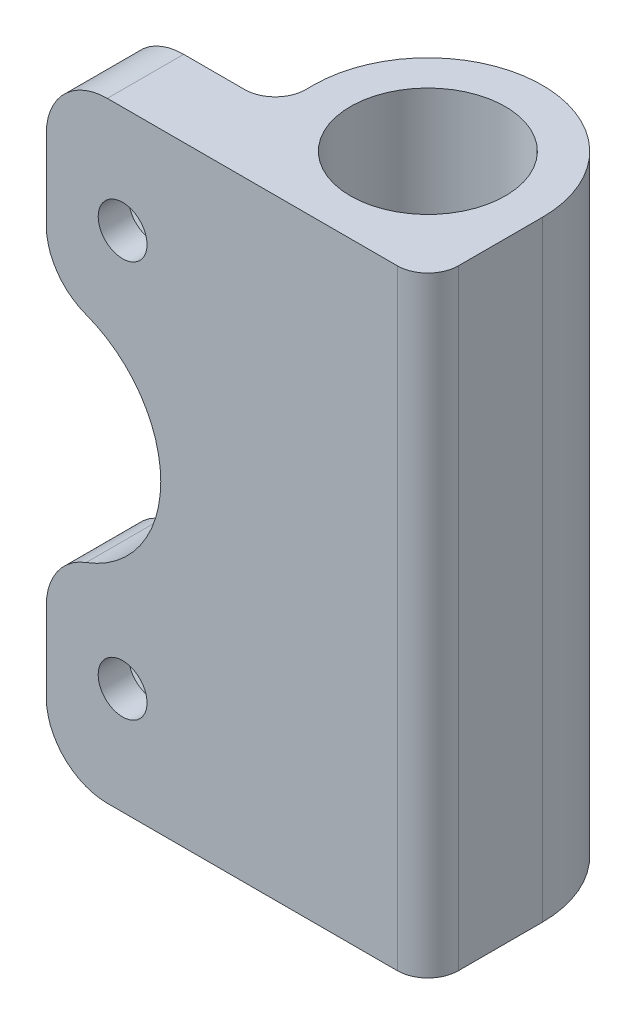
ISO-10303-21;
HEADER;
FILE_DESCRIPTION(('STEP AP214'),'2;1');
FILE_NAME('part.step','',(''),(''),'','','');
FILE_SCHEMA(('AUTOMOTIVE_DESIGN { 1 0 10303 214 1 1 1 1 }'));
ENDSEC;
DATA;
#1=APPLICATION_CONTEXT('core data for automotive mechanical design processes');
#2=APPLICATION_PROTOCOL_DEFINITION('international standard','automotive_design',2000,#1);
#3=PRODUCT_CONTEXT('',#1,'mechanical');
#4=PRODUCT('Part','Part','',(#3));
#5=PRODUCT_RELATED_PRODUCT_CATEGORY('part','',(#4));
#6=PRODUCT_DEFINITION_FORMATION('','',#4);
#7=PRODUCT_DEFINITION_CONTEXT('part definition',#1,'design');
#8=PRODUCT_DEFINITION('design','',#6,#7);
#9=PRODUCT_DEFINITION_SHAPE('','',#8);
#10=(LENGTH_UNIT() NAMED_UNIT(*) SI_UNIT(.MILLI.,.METRE.));
#11=(NAMED_UNIT(*) PLANE_ANGLE_UNIT() SI_UNIT($,.RADIAN.));
#12=(NAMED_UNIT(*) SI_UNIT($,.STERADIAN.) SOLID_ANGLE_UNIT());
#13=UNCERTAINTY_MEASURE_WITH_UNIT(LENGTH_MEASURE(1.E-05),#10,'distance_accuracy_value','');
#14=(GEOMETRIC_REPRESENTATION_CONTEXT(3) GLOBAL_UNCERTAINTY_ASSIGNED_CONTEXT((#13)) GLOBAL_UNIT_ASSIGNED_CONTEXT((#10,
#11,#12)) REPRESENTATION_CONTEXT('',''));
#15=CARTESIAN_POINT('',(0.,0.,0.));
#16=DIRECTION('',(0.,0.,1.));
#17=DIRECTION('',(1.,0.,0.));
#18=AXIS2_PLACEMENT_3D('',#15,#16,#17);
#19=CARTESIAN_POINT('',(-17.5,40.,2.5));
#20=DIRECTION('',(1.,0.,0.));
#21=DIRECTION('',(0.,0.,-1.));
#22=AXIS2_PLACEMENT_3D('',#19,#20,#21);
#23=PLANE('',#22);
#24=DIRECTION('',(0.,-1.,0.));
#25=VECTOR('',#24,1.);
#26=CARTESIAN_POINT('',(-17.5,40.,2.5));
#27=LINE('',#26,#25);
#28=CARTESIAN_POINT('',(-17.5,9.21807067357609,2.5));
#29=VERTEX_POINT('',#28);
#30=CARTESIAN_POINT('',(-17.5,4.,2.5));
#31=VERTEX_POINT('',#30);
#32=EDGE_CURVE('E344',#29,#31,#27,.T.);
#33=ORIENTED_EDGE('',*,*,#32,.T.);
#34=DIRECTION('',(0.,0.,1.));
#35=VECTOR('',#34,1.);
#36=CARTESIAN_POINT('',(-17.5,4.,2.5));
#37=LINE('',#36,#35);
#38=CARTESIAN_POINT('',(-17.5,4.,7.5));
#39=VERTEX_POINT('',#38);
#40=EDGE_CURVE('E374',#31,#39,#37,.T.);
#41=ORIENTED_EDGE('',*,*,#40,.T.);
#42=DIRECTION('',(0.,-1.,0.));
#43=VECTOR('',#42,1.);
#44=CARTESIAN_POINT('',(-17.5,40.,7.5));
#45=LINE('',#44,#43);
#46=CARTESIAN_POINT('',(-17.5,9.21807067357609,7.5));
#47=VERTEX_POINT('',#46);
#48=EDGE_CURVE('E363',#47,#39,#45,.T.);
#49=ORIENTED_EDGE('',*,*,#48,.F.);
#50=DIRECTION('',(0.,0.,-1.));
#51=VECTOR('',#50,1.);
#52=CARTESIAN_POINT('',(-17.5,9.21807067357609,2.5));
#53=LINE('',#52,#51);
#54=EDGE_CURVE('E367',#47,#29,#53,.T.);
#55=ORIENTED_EDGE('',*,*,#54,.T.);
#56=EDGE_LOOP('',(#33,#41,#49,#55));
#57=FACE_BOUND('',#56,.T.);
#58=ADVANCED_FACE('F33',(#57),#23,.F.);
#59=CARTESIAN_POINT('',(-12.5,33.,7.5));
#60=DIRECTION('',(0.,0.,-1.));
#61=DIRECTION('',(-1.,0.,0.));
#62=AXIS2_PLACEMENT_3D('',#59,#60,#61);
#63=CYLINDRICAL_SURFACE('',#62,1.6);
#64=CARTESIAN_POINT('',(-12.5,33.,7.5));
#65=DIRECTION('',(0.,0.,-1.));
#66=DIRECTION('',(-1.,0.,0.));
#67=AXIS2_PLACEMENT_3D('',#64,#65,#66);
#68=CIRCLE('',#67,1.6);
#69=CARTESIAN_POINT('',(-14.1,33.,7.5));
#70=VERTEX_POINT('',#69);
#71=EDGE_CURVE('E322',#70,#70,#68,.T.);
#72=ORIENTED_EDGE('',*,*,#71,.F.);
#73=EDGE_LOOP('',(#72));
#74=FACE_BOUND('',#73,.T.);
#75=CARTESIAN_POINT('',(-12.5,33.,5.5));
#76=DIRECTION('',(0.,0.,-1.));
#77=DIRECTION('',(-1.,0.,0.));
#78=AXIS2_PLACEMENT_3D('',#75,#76,#77);
#79=CIRCLE('',#78,1.6);
#80=CARTESIAN_POINT('',(-14.1,33.,5.5));
#81=VERTEX_POINT('',#80);
#82=EDGE_CURVE('E325',#81,#81,#79,.F.);
#83=ORIENTED_EDGE('',*,*,#82,.F.);
#84=EDGE_LOOP('',(#83));
#85=FACE_BOUND('',#84,.T.);
#86=ADVANCED_FACE('F496',(#74,#85),#63,.F.);
#87=CARTESIAN_POINT('',(0.,40.,0.));
#88=DIRECTION('',(0.,1.,0.));
#89=DIRECTION('',(0.,0.,1.));
#90=AXIS2_PLACEMENT_3D('',#87,#88,#89);
#91=PLANE('',#90);
#92=DIRECTION('',(1.,0.,0.));
#93=VECTOR('',#92,1.);
#94=CARTESIAN_POINT('',(-17.5,40.,7.5));
#95=LINE('',#94,#93);
#96=CARTESIAN_POINT('',(-13.5,40.,7.5));
#97=VERTEX_POINT('',#96);
#98=CARTESIAN_POINT('',(5.5,40.,7.5));
#99=VERTEX_POINT('',#98);
#100=EDGE_CURVE('E332',#97,#99,#95,.T.);
#101=ORIENTED_EDGE('',*,*,#100,.T.);
#102=CARTESIAN_POINT('',(5.5,40.,5.5));
#103=DIRECTION('',(0.,1.,0.));
#104=DIRECTION('',(0.,0.,1.));
#105=AXIS2_PLACEMENT_3D('',#102,#103,#104);
#106=CIRCLE('',#105,2.);
#107=CARTESIAN_POINT('',(7.5,40.,5.5));
#108=VERTEX_POINT('',#107);
#109=EDGE_CURVE('E416',#99,#108,#106,.T.);
#110=ORIENTED_EDGE('',*,*,#109,.T.);
#111=DIRECTION('',(0.,0.,-1.));
#112=VECTOR('',#111,1.);
#113=CARTESIAN_POINT('',(7.5,40.,7.5));
#114=LINE('',#113,#112);
#115=CARTESIAN_POINT('',(7.5,40.,0.));
#116=VERTEX_POINT('',#115);
#117=EDGE_CURVE('E335',#108,#116,#114,.T.);
#118=ORIENTED_EDGE('',*,*,#117,.T.);
#119=CARTESIAN_POINT('',(0.,40.,0.));
#120=DIRECTION('',(0.,1.,0.));
#121=DIRECTION('',(0.,0.,1.));
#122=AXIS2_PLACEMENT_3D('',#119,#120,#121);
#123=CIRCLE('',#122,7.5);
#124=CARTESIAN_POINT('',(-7.5,40.,0.));
#125=VERTEX_POINT('',#124);
#126=EDGE_CURVE('E338',#116,#125,#123,.T.);
#127=ORIENTED_EDGE('',*,*,#126,.T.);
#128=DIRECTION('',(0.,0.,1.));
#129=VECTOR('',#128,1.);
#130=CARTESIAN_POINT('',(-7.5,40.,0.));
#131=LINE('',#130,#129);
#132=CARTESIAN_POINT('',(-7.5,40.,0.500000000000002));
#133=VERTEX_POINT('',#132);
#134=EDGE_CURVE('E340',#125,#133,#131,.T.);
#135=ORIENTED_EDGE('',*,*,#134,.T.);
#136=CARTESIAN_POINT('',(-9.5,40.,0.500000000000002));
#137=DIRECTION('',(0.,1.,0.));
#138=DIRECTION('',(0.,0.,1.));
#139=AXIS2_PLACEMENT_3D('',#136,#137,#138);
#140=CIRCLE('',#139,2.);
#141=CARTESIAN_POINT('',(-9.5,40.,2.5));
#142=VERTEX_POINT('',#141);
#143=EDGE_CURVE('E11',#133,#142,#140,.F.);
#144=ORIENTED_EDGE('',*,*,#143,.T.);
#145=DIRECTION('',(-1.,0.,0.));
#146=VECTOR('',#145,1.);
#147=CARTESIAN_POINT('',(-7.5,40.,2.5));
#148=LINE('',#147,#146);
#149=CARTESIAN_POINT('',(-13.5,40.,2.5));
#150=VERTEX_POINT('',#149);
#151=EDGE_CURVE('E342',#142,#150,#148,.T.);
#152=ORIENTED_EDGE('',*,*,#151,.T.);
#153=DIRECTION('',(0.,0.,1.));
#154=VECTOR('',#153,1.);
#155=CARTESIAN_POINT('',(-13.5,40.,7.5));
#156=LINE('',#155,#154);
#157=EDGE_CURVE('E402',#150,#97,#156,.T.);
#158=ORIENTED_EDGE('',*,*,#157,.T.);
#159=EDGE_LOOP('',(#101,#110,#118,#127,#135,#144,#152,#158));
#160=FACE_BOUND('',#159,.T.);
#161=CARTESIAN_POINT('',(0.,40.,0.));
#162=DIRECTION('',(0.,1.,0.));
#163=DIRECTION('',(0.,0.,1.));
#164=AXIS2_PLACEMENT_3D('',#161,#162,#163);
#165=CIRCLE('',#164,5.075);
#166=CARTESIAN_POINT('',(0.,40.,5.075));
#167=VERTEX_POINT('',#166);
#168=EDGE_CURVE('E326',#167,#167,#165,.T.);
#169=ORIENTED_EDGE('',*,*,#168,.F.);
#170=EDGE_LOOP('',(#169));
#171=FACE_BOUND('',#170,.T.);
#172=ADVANCED_FACE('F437',(#160,#171),#91,.T.);
#173=CARTESIAN_POINT('',(0.,0.,0.));
#174=DIRECTION('',(0.,1.,0.));
#175=DIRECTION('',(0.,0.,1.));
#176=AXIS2_PLACEMENT_3D('',#173,#174,#175);
#177=PLANE('',#176);
#178=DIRECTION('',(0.,0.,-1.));
#179=VECTOR('',#178,1.);
#180=CARTESIAN_POINT('',(7.5,0.,7.5));
#181=LINE('',#180,#179);
#182=CARTESIAN_POINT('',(7.5,0.,5.5));
#183=VERTEX_POINT('',#182);
#184=CARTESIAN_POINT('',(7.5,0.,0.));
#185=VERTEX_POINT('',#184);
#186=EDGE_CURVE('E347',#183,#185,#181,.T.);
#187=ORIENTED_EDGE('',*,*,#186,.F.);
#188=CARTESIAN_POINT('',(5.5,0.,5.5));
#189=DIRECTION('',(0.,1.,0.));
#190=DIRECTION('',(0.,0.,1.));
#191=AXIS2_PLACEMENT_3D('',#188,#189,#190);
#192=CIRCLE('',#191,2.);
#193=CARTESIAN_POINT('',(5.5,0.,7.5));
#194=VERTEX_POINT('',#193);
#195=EDGE_CURVE('E412',#183,#194,#192,.F.);
#196=ORIENTED_EDGE('',*,*,#195,.T.);
#197=DIRECTION('',(1.,0.,0.));
#198=VECTOR('',#197,1.);
#199=CARTESIAN_POINT('',(-17.5,0.,7.5));
#200=LINE('',#199,#198);
#201=CARTESIAN_POINT('',(-13.5,0.,7.5));
#202=VERTEX_POINT('',#201);
#203=EDGE_CURVE('E329',#202,#194,#200,.T.);
#204=ORIENTED_EDGE('',*,*,#203,.F.);
#205=DIRECTION('',(0.,0.,1.));
#206=VECTOR('',#205,1.);
#207=CARTESIAN_POINT('',(-13.5,0.,0.));
#208=LINE('',#207,#206);
#209=CARTESIAN_POINT('',(-13.5,0.,2.5));
#210=VERTEX_POINT('',#209);
#211=EDGE_CURVE('E385',#202,#210,#208,.F.);
#212=ORIENTED_EDGE('',*,*,#211,.T.);
#213=DIRECTION('',(-1.,0.,0.));
#214=VECTOR('',#213,1.);
#215=CARTESIAN_POINT('',(-7.5,0.,2.5));
#216=LINE('',#215,#214);
#217=CARTESIAN_POINT('',(-9.5,0.,2.5));
#218=VERTEX_POINT('',#217);
#219=EDGE_CURVE('E336',#218,#210,#216,.T.);
#220=ORIENTED_EDGE('',*,*,#219,.F.);
#221=CARTESIAN_POINT('',(-9.5,0.,0.500000000000002));
#222=DIRECTION('',(0.,1.,0.));
#223=DIRECTION('',(0.,0.,1.));
#224=AXIS2_PLACEMENT_3D('',#221,#222,#223);
#225=CIRCLE('',#224,2.);
#226=CARTESIAN_POINT('',(-7.5,0.,0.500000000000002));
#227=VERTEX_POINT('',#226);
#228=EDGE_CURVE('E41',#218,#227,#225,.T.);
#229=ORIENTED_EDGE('',*,*,#228,.T.);
#230=DIRECTION('',(0.,0.,1.));
#231=VECTOR('',#230,1.);
#232=CARTESIAN_POINT('',(-7.5,0.,0.));
#233=LINE('',#232,#231);
#234=CARTESIAN_POINT('',(-7.5,0.,0.));
#235=VERTEX_POINT('',#234);
#236=EDGE_CURVE('E351',#235,#227,#233,.T.);
#237=ORIENTED_EDGE('',*,*,#236,.F.);
#238=CARTESIAN_POINT('',(0.,0.,0.));
#239=DIRECTION('',(0.,1.,0.));
#240=DIRECTION('',(0.,0.,1.));
#241=AXIS2_PLACEMENT_3D('',#238,#239,#240);
#242=CIRCLE('',#241,7.5);
#243=EDGE_CURVE('E349',#185,#235,#242,.T.);
#244=ORIENTED_EDGE('',*,*,#243,.F.);
#245=EDGE_LOOP('',(#187,#196,#204,#212,#220,#229,#237,#244));
#246=FACE_BOUND('',#245,.T.);
#247=CARTESIAN_POINT('',(0.,0.,0.));
#248=DIRECTION('',(0.,1.,0.));
#249=DIRECTION('',(0.,0.,1.));
#250=AXIS2_PLACEMENT_3D('',#247,#248,#249);
#251=CIRCLE('',#250,5.075);
#252=CARTESIAN_POINT('',(0.,0.,5.075));
#253=VERTEX_POINT('',#252);
#254=EDGE_CURVE('E321',#253,#253,#251,.T.);
#255=ORIENTED_EDGE('',*,*,#254,.T.);
#256=EDGE_LOOP('',(#255));
#257=FACE_BOUND('',#256,.T.);
#258=ADVANCED_FACE('F425',(#246,#257),#177,.F.);
#259=CARTESIAN_POINT('',(-17.5,36.,7.5));
#260=VERTEX_POINT('',#259);
#261=CARTESIAN_POINT('',(-17.5,30.7819293264239,7.5));
#262=VERTEX_POINT('',#261);
#263=EDGE_CURVE('E364',#260,#262,#45,.T.);
#264=ORIENTED_EDGE('',*,*,#263,.F.);
#265=DIRECTION('',(0.,0.,1.));
#266=VECTOR('',#265,1.);
#267=CARTESIAN_POINT('',(-17.5,36.,2.5));
#268=LINE('',#267,#266);
#269=CARTESIAN_POINT('',(-17.5,36.,2.5));
#270=VERTEX_POINT('',#269);
#271=EDGE_CURVE('E407',#260,#270,#268,.F.);
#272=ORIENTED_EDGE('',*,*,#271,.T.);
#273=CARTESIAN_POINT('',(-17.5,30.7819293264239,2.5));
#274=VERTEX_POINT('',#273);
#275=EDGE_CURVE('E354',#270,#274,#27,.T.);
#276=ORIENTED_EDGE('',*,*,#275,.T.);
#277=DIRECTION('',(0.,0.,-1.));
#278=VECTOR('',#277,1.);
#279=CARTESIAN_POINT('',(-17.5,30.7819293264239,2.5));
#280=LINE('',#279,#278);
#281=EDGE_CURVE('E405',#274,#262,#280,.F.);
#282=ORIENTED_EDGE('',*,*,#281,.T.);
#283=EDGE_LOOP('',(#264,#272,#276,#282));
#284=FACE_BOUND('',#283,.T.);
#285=ADVANCED_FACE('F484',(#284),#23,.F.);
#286=CARTESIAN_POINT('',(-17.5,40.,7.5));
#287=DIRECTION('',(0.,0.,-1.));
#288=DIRECTION('',(-1.,0.,0.));
#289=AXIS2_PLACEMENT_3D('',#286,#287,#288);
#290=PLANE('',#289);
#291=CARTESIAN_POINT('',(-12.5,7.,7.5));
#292=DIRECTION('',(0.,0.,-1.));
#293=DIRECTION('',(-1.,0.,0.));
#294=AXIS2_PLACEMENT_3D('',#291,#292,#293);
#295=CIRCLE('',#294,1.6);
#296=CARTESIAN_POINT('',(-14.1,7.,7.5));
#297=VERTEX_POINT('',#296);
#298=EDGE_CURVE('E318',#297,#297,#295,.T.);
#299=ORIENTED_EDGE('',*,*,#298,.T.);
#300=EDGE_LOOP('',(#299));
#301=FACE_BOUND('',#300,.T.);
#302=ORIENTED_EDGE('',*,*,#71,.T.);
#303=EDGE_LOOP('',(#302));
#304=FACE_BOUND('',#303,.T.);
#305=ORIENTED_EDGE('',*,*,#203,.T.);
#306=DIRECTION('',(0.,-1.,0.));
#307=VECTOR('',#306,1.);
#308=CARTESIAN_POINT('',(5.5,40.,7.5));
#309=LINE('',#308,#307);
#310=EDGE_CURVE('E414',#194,#99,#309,.F.);
#311=ORIENTED_EDGE('',*,*,#310,.T.);
#312=ORIENTED_EDGE('',*,*,#100,.F.);
#313=CARTESIAN_POINT('',(-13.5,36.,7.5));
#314=DIRECTION('',(0.,0.,-1.));
#315=DIRECTION('',(-1.,0.,0.));
#316=AXIS2_PLACEMENT_3D('',#313,#314,#315);
#317=CIRCLE('',#316,4.);
#318=EDGE_CURVE('E379',#97,#260,#317,.F.);
#319=ORIENTED_EDGE('',*,*,#318,.T.);
#320=ORIENTED_EDGE('',*,*,#263,.T.);
#321=CARTESIAN_POINT('',(-13.5,30.7819293264239,7.5));
#322=DIRECTION('',(0.,0.,-1.));
#323=DIRECTION('',(-1.,0.,0.));
#324=AXIS2_PLACEMENT_3D('',#321,#322,#323);
#325=CIRCLE('',#324,4.);
#326=CARTESIAN_POINT('',(-14.8913043478261,27.0316930389721,7.5));
#327=VERTEX_POINT('',#326);
#328=EDGE_CURVE('E377',#262,#327,#325,.F.);
#329=ORIENTED_EDGE('',*,*,#328,.T.);
#330=CARTESIAN_POINT('',(-17.5,20.,7.5));
#331=DIRECTION('',(0.,0.,-1.));
#332=DIRECTION('',(-1.,0.,0.));
#333=AXIS2_PLACEMENT_3D('',#330,#331,#332);
#334=CIRCLE('',#333,7.5);
#335=CARTESIAN_POINT('',(-14.8913043478261,12.9683069610279,7.5));
#336=VERTEX_POINT('',#335);
#337=EDGE_CURVE('E293',#327,#336,#334,.T.);
#338=ORIENTED_EDGE('',*,*,#337,.T.);
#339=CARTESIAN_POINT('',(-13.5,9.21807067357609,7.5));
#340=DIRECTION('',(0.,0.,-1.));
#341=DIRECTION('',(-1.,0.,0.));
#342=AXIS2_PLACEMENT_3D('',#339,#340,#341);
#343=CIRCLE('',#342,4.);
#344=EDGE_CURVE('E381',#336,#47,#343,.F.);
#345=ORIENTED_EDGE('',*,*,#344,.T.);
#346=ORIENTED_EDGE('',*,*,#48,.T.);
#347=CARTESIAN_POINT('',(-13.5,4.,7.5));
#348=DIRECTION('',(0.,0.,-1.));
#349=DIRECTION('',(-1.,0.,0.));
#350=AXIS2_PLACEMENT_3D('',#347,#348,#349);
#351=CIRCLE('',#350,4.);
#352=EDGE_CURVE('E383',#39,#202,#351,.F.);
#353=ORIENTED_EDGE('',*,*,#352,.T.);
#354=EDGE_LOOP('',(#305,#311,#312,#319,#320,#329,#338,#345,#346,#353));
#355=FACE_BOUND('',#354,.T.);
#356=ADVANCED_FACE('F443',(#301,#304,#355),#290,.F.);
#357=CARTESIAN_POINT('',(7.5,40.,7.5));
#358=DIRECTION('',(-1.,0.,0.));
#359=DIRECTION('',(0.,0.,1.));
#360=AXIS2_PLACEMENT_3D('',#357,#358,#359);
#361=PLANE('',#360);
#362=ORIENTED_EDGE('',*,*,#117,.F.);
#363=DIRECTION('',(0.,-1.,0.));
#364=VECTOR('',#363,1.);
#365=CARTESIAN_POINT('',(7.5,40.,5.5));
#366=LINE('',#365,#364);
#367=EDGE_CURVE('E409',#108,#183,#366,.T.);
#368=ORIENTED_EDGE('',*,*,#367,.T.);
#369=ORIENTED_EDGE('',*,*,#186,.T.);
#370=DIRECTION('',(0.,-1.,0.));
#371=VECTOR('',#370,1.);
#372=CARTESIAN_POINT('',(7.5,40.,0.));
#373=LINE('',#372,#371);
#374=EDGE_CURVE('E360',#116,#185,#373,.T.);
#375=ORIENTED_EDGE('',*,*,#374,.F.);
#376=EDGE_LOOP('',(#362,#368,#369,#375));
#377=FACE_BOUND('',#376,.T.);
#378=ADVANCED_FACE('F453',(#377),#361,.F.);
#379=CARTESIAN_POINT('',(0.,40.,0.));
#380=DIRECTION('',(0.,-1.,0.));
#381=DIRECTION('',(0.,0.,-1.));
#382=AXIS2_PLACEMENT_3D('',#379,#380,#381);
#383=CYLINDRICAL_SURFACE('',#382,7.5);
#384=ORIENTED_EDGE('',*,*,#243,.T.);
#385=DIRECTION('',(0.,-1.,0.));
#386=VECTOR('',#385,1.);
#387=CARTESIAN_POINT('',(-7.5,40.,0.));
#388=LINE('',#387,#386);
#389=EDGE_CURVE('E357',#125,#235,#388,.T.);
#390=ORIENTED_EDGE('',*,*,#389,.F.);
#391=ORIENTED_EDGE('',*,*,#126,.F.);
#392=ORIENTED_EDGE('',*,*,#374,.T.);
#393=EDGE_LOOP('',(#384,#390,#391,#392));
#394=FACE_BOUND('',#393,.T.);
#395=ADVANCED_FACE('F456',(#394),#383,.T.);
#396=CARTESIAN_POINT('',(-7.5,40.,0.));
#397=DIRECTION('',(1.,0.,0.));
#398=DIRECTION('',(0.,0.,-1.));
#399=AXIS2_PLACEMENT_3D('',#396,#397,#398);
#400=PLANE('',#399);
#401=ORIENTED_EDGE('',*,*,#236,.T.);
#402=DIRECTION('',(0.,-1.,0.));
#403=VECTOR('',#402,1.);
#404=CARTESIAN_POINT('',(-7.5,40.,0.500000000000002));
#405=LINE('',#404,#403);
#406=EDGE_CURVE('E48',#227,#133,#405,.F.);
#407=ORIENTED_EDGE('',*,*,#406,.T.);
#408=ORIENTED_EDGE('',*,*,#134,.F.);
#409=ORIENTED_EDGE('',*,*,#389,.T.);
#410=EDGE_LOOP('',(#401,#407,#408,#409));
#411=FACE_BOUND('',#410,.T.);
#412=ADVANCED_FACE('F430',(#411),#400,.F.);
#413=CARTESIAN_POINT('',(-7.5,40.,2.5));
#414=DIRECTION('',(0.,0.,1.));
#415=DIRECTION('',(1.,0.,0.));
#416=AXIS2_PLACEMENT_3D('',#413,#414,#415);
#417=PLANE('',#416);
#418=DIRECTION('',(0.,1.,0.));
#419=VECTOR('',#418,1.);
#420=CARTESIAN_POINT('',(-15.3,31.383419246269,2.5));
#421=LINE('',#420,#419);
#422=CARTESIAN_POINT('',(-15.3,31.383419246269,2.5));
#423=VERTEX_POINT('',#422);
#424=CARTESIAN_POINT('',(-15.3,34.6165807537309,2.5));
#425=VERTEX_POINT('',#424);
#426=EDGE_CURVE('E249',#423,#425,#421,.T.);
#427=ORIENTED_EDGE('',*,*,#426,.F.);
#428=DIRECTION('',(-0.866025403784438,0.500000000000001,0.));
#429=VECTOR('',#428,1.);
#430=CARTESIAN_POINT('',(-12.5,29.7668384925381,2.5));
#431=LINE('',#430,#429);
#432=CARTESIAN_POINT('',(-12.5,29.7668384925381,2.5));
#433=VERTEX_POINT('',#432);
#434=EDGE_CURVE('E213',#433,#423,#431,.T.);
#435=ORIENTED_EDGE('',*,*,#434,.F.);
#436=DIRECTION('',(-0.866025403784439,-0.5,0.));
#437=VECTOR('',#436,1.);
#438=CARTESIAN_POINT('',(-9.7,31.383419246269,2.5));
#439=LINE('',#438,#437);
#440=CARTESIAN_POINT('',(-9.7,31.383419246269,2.5));
#441=VERTEX_POINT('',#440);
#442=EDGE_CURVE('E232',#441,#433,#439,.T.);
#443=ORIENTED_EDGE('',*,*,#442,.F.);
#444=DIRECTION('',(0.,-1.,0.));
#445=VECTOR('',#444,1.);
#446=CARTESIAN_POINT('',(-9.7,34.6165807537309,2.5));
#447=LINE('',#446,#445);
#448=CARTESIAN_POINT('',(-9.7,34.6165807537309,2.5));
#449=VERTEX_POINT('',#448);
#450=EDGE_CURVE('E235',#449,#441,#447,.T.);
#451=ORIENTED_EDGE('',*,*,#450,.F.);
#452=DIRECTION('',(0.866025403784438,-0.500000000000001,0.));
#453=VECTOR('',#452,1.);
#454=CARTESIAN_POINT('',(-12.5,36.2331615074619,2.5));
#455=LINE('',#454,#453);
#456=CARTESIAN_POINT('',(-12.5,36.2331615074619,2.5));
#457=VERTEX_POINT('',#456);
#458=EDGE_CURVE('E255',#457,#449,#455,.T.);
#459=ORIENTED_EDGE('',*,*,#458,.F.);
#460=DIRECTION('',(0.866025403784438,0.500000000000002,0.));
#461=VECTOR('',#460,1.);
#462=CARTESIAN_POINT('',(-15.3,34.6165807537309,2.5));
#463=LINE('',#462,#461);
#464=EDGE_CURVE('E252',#425,#457,#463,.T.);
#465=ORIENTED_EDGE('',*,*,#464,.F.);
#466=EDGE_LOOP('',(#427,#435,#443,#451,#459,#465));
#467=FACE_BOUND('',#466,.T.);
#468=DIRECTION('',(0.,-1.,0.));
#469=VECTOR('',#468,1.);
#470=CARTESIAN_POINT('',(-9.7,5.38341924626905,2.5));
#471=LINE('',#470,#469);
#472=CARTESIAN_POINT('',(-9.7,8.61658075373096,2.5));
#473=VERTEX_POINT('',#472);
#474=CARTESIAN_POINT('',(-9.7,5.38341924626905,2.5));
#475=VERTEX_POINT('',#474);
#476=EDGE_CURVE('E292',#473,#475,#471,.T.);
#477=ORIENTED_EDGE('',*,*,#476,.F.);
#478=DIRECTION('',(0.866025403784439,-0.5,0.));
#479=VECTOR('',#478,1.);
#480=CARTESIAN_POINT('',(-9.7,8.61658075373096,2.5));
#481=LINE('',#480,#479);
#482=CARTESIAN_POINT('',(-12.5,10.2331615074619,2.5));
#483=VERTEX_POINT('',#482);
#484=EDGE_CURVE('E290',#483,#473,#481,.T.);
#485=ORIENTED_EDGE('',*,*,#484,.F.);
#486=DIRECTION('',(0.866025403784438,0.500000000000001,0.));
#487=VECTOR('',#486,1.);
#488=CARTESIAN_POINT('',(-12.5,10.2331615074619,2.5));
#489=LINE('',#488,#487);
#490=CARTESIAN_POINT('',(-15.3,8.61658075373096,2.5));
#491=VERTEX_POINT('',#490);
#492=EDGE_CURVE('E274',#491,#483,#489,.T.);
#493=ORIENTED_EDGE('',*,*,#492,.F.);
#494=DIRECTION('',(0.,1.,0.));
#495=VECTOR('',#494,1.);
#496=CARTESIAN_POINT('',(-15.3,8.61658075373096,2.5));
#497=LINE('',#496,#495);
#498=CARTESIAN_POINT('',(-15.3,5.38341924626906,2.5));
#499=VERTEX_POINT('',#498);
#500=EDGE_CURVE('E302',#499,#491,#497,.T.);
#501=ORIENTED_EDGE('',*,*,#500,.F.);
#502=DIRECTION('',(-0.866025403784438,0.5,0.));
#503=VECTOR('',#502,1.);
#504=CARTESIAN_POINT('',(-15.3,5.38341924626906,2.5));
#505=LINE('',#504,#503);
#506=CARTESIAN_POINT('',(-12.5,3.76683849253811,2.5));
#507=VERTEX_POINT('',#506);
#508=EDGE_CURVE('E299',#507,#499,#505,.T.);
#509=ORIENTED_EDGE('',*,*,#508,.F.);
#510=DIRECTION('',(-0.866025403784439,-0.5,0.));
#511=VECTOR('',#510,1.);
#512=CARTESIAN_POINT('',(-12.5,3.76683849253811,2.5));
#513=LINE('',#512,#511);
#514=EDGE_CURVE('E296',#475,#507,#513,.T.);
#515=ORIENTED_EDGE('',*,*,#514,.F.);
#516=EDGE_LOOP('',(#477,#485,#493,#501,#509,#515));
#517=FACE_BOUND('',#516,.T.);
#518=ORIENTED_EDGE('',*,*,#151,.F.);
#519=DIRECTION('',(0.,-1.,0.));
#520=VECTOR('',#519,1.);
#521=CARTESIAN_POINT('',(-9.5,0.,2.5));
#522=LINE('',#521,#520);
#523=EDGE_CURVE('E418',#142,#218,#522,.T.);
#524=ORIENTED_EDGE('',*,*,#523,.T.);
#525=ORIENTED_EDGE('',*,*,#219,.T.);
#526=CARTESIAN_POINT('',(-13.5,4.,2.5));
#527=DIRECTION('',(0.,0.,1.));
#528=DIRECTION('',(1.,0.,0.));
#529=AXIS2_PLACEMENT_3D('',#526,#527,#528);
#530=CIRCLE('',#529,4.);
#531=EDGE_CURVE('E395',#210,#31,#530,.F.);
#532=ORIENTED_EDGE('',*,*,#531,.T.);
#533=ORIENTED_EDGE('',*,*,#32,.F.);
#534=CARTESIAN_POINT('',(-13.5,9.21807067357609,2.5));
#535=DIRECTION('',(0.,0.,1.));
#536=DIRECTION('',(1.,0.,0.));
#537=AXIS2_PLACEMENT_3D('',#534,#535,#536);
#538=CIRCLE('',#537,4.);
#539=CARTESIAN_POINT('',(-14.8913043478261,12.9683069610279,2.5));
#540=VERTEX_POINT('',#539);
#541=EDGE_CURVE('E393',#29,#540,#538,.F.);
#542=ORIENTED_EDGE('',*,*,#541,.T.);
#543=CARTESIAN_POINT('',(-17.5,20.,2.5));
#544=DIRECTION('',(0.,0.,-1.));
#545=DIRECTION('',(-1.,0.,0.));
#546=AXIS2_PLACEMENT_3D('',#543,#544,#545);
#547=CIRCLE('',#546,7.5);
#548=CARTESIAN_POINT('',(-14.8913043478261,27.0316930389721,2.5));
#549=VERTEX_POINT('',#548);
#550=EDGE_CURVE('E238',#549,#540,#547,.T.);
#551=ORIENTED_EDGE('',*,*,#550,.F.);
#552=CARTESIAN_POINT('',(-13.5,30.7819293264239,2.5));
#553=DIRECTION('',(0.,0.,1.));
#554=DIRECTION('',(1.,0.,0.));
#555=AXIS2_PLACEMENT_3D('',#552,#553,#554);
#556=CIRCLE('',#555,4.);
#557=EDGE_CURVE('E388',#549,#274,#556,.F.);
#558=ORIENTED_EDGE('',*,*,#557,.T.);
#559=ORIENTED_EDGE('',*,*,#275,.F.);
#560=CARTESIAN_POINT('',(-13.5,36.,2.5));
#561=DIRECTION('',(0.,0.,1.));
#562=DIRECTION('',(1.,0.,0.));
#563=AXIS2_PLACEMENT_3D('',#560,#561,#562);
#564=CIRCLE('',#563,4.);
#565=EDGE_CURVE('E390',#270,#150,#564,.F.);
#566=ORIENTED_EDGE('',*,*,#565,.T.);
#567=EDGE_LOOP('',(#518,#524,#525,#532,#533,#542,#551,#558,#559,#566));
#568=FACE_BOUND('',#567,.T.);
#569=ADVANCED_FACE('F433',(#467,#517,#568),#417,.F.);
#570=CARTESIAN_POINT('',(0.,40.,0.));
#571=DIRECTION('',(0.,-1.,0.));
#572=DIRECTION('',(0.,0.,-1.));
#573=AXIS2_PLACEMENT_3D('',#570,#571,#572);
#574=CYLINDRICAL_SURFACE('',#573,5.075);
#575=ORIENTED_EDGE('',*,*,#168,.T.);
#576=EDGE_LOOP('',(#575));
#577=FACE_BOUND('',#576,.T.);
#578=ORIENTED_EDGE('',*,*,#254,.F.);
#579=EDGE_LOOP('',(#578));
#580=FACE_BOUND('',#579,.T.);
#581=ADVANCED_FACE('F520',(#577,#580),#574,.F.);
#582=CARTESIAN_POINT('',(-12.5,7.,7.5));
#583=DIRECTION('',(0.,0.,-1.));
#584=DIRECTION('',(-1.,0.,0.));
#585=AXIS2_PLACEMENT_3D('',#582,#583,#584);
#586=CYLINDRICAL_SURFACE('',#585,1.6);
#587=CARTESIAN_POINT('',(-12.5,7.,5.5));
#588=DIRECTION('',(0.,0.,1.));
#589=DIRECTION('',(1.,0.,0.));
#590=AXIS2_PLACEMENT_3D('',#587,#588,#589);
#591=CIRCLE('',#590,1.6);
#592=CARTESIAN_POINT('',(-10.9,7.,5.5));
#593=VERTEX_POINT('',#592);
#594=EDGE_CURVE('E262',#593,#593,#591,.F.);
#595=ORIENTED_EDGE('',*,*,#594,.T.);
#596=EDGE_LOOP('',(#595));
#597=FACE_BOUND('',#596,.T.);
#598=ORIENTED_EDGE('',*,*,#298,.F.);
#599=EDGE_LOOP('',(#598));
#600=FACE_BOUND('',#599,.T.);
#601=ADVANCED_FACE('F550',(#597,#600),#586,.F.);
#602=CARTESIAN_POINT('',(0.,0.,5.5));
#603=DIRECTION('',(0.,0.,1.));
#604=DIRECTION('',(1.,0.,0.));
#605=AXIS2_PLACEMENT_3D('',#602,#603,#604);
#606=PLANE('',#605);
#607=DIRECTION('',(0.866025403784439,-0.5,0.));
#608=VECTOR('',#607,1.);
#609=CARTESIAN_POINT('',(-9.7,8.61658075373096,5.5));
#610=LINE('',#609,#608);
#611=CARTESIAN_POINT('',(-12.5,10.2331615074619,5.5));
#612=VERTEX_POINT('',#611);
#613=CARTESIAN_POINT('',(-9.7,8.61658075373096,5.5));
#614=VERTEX_POINT('',#613);
#615=EDGE_CURVE('E270',#612,#614,#610,.T.);
#616=ORIENTED_EDGE('',*,*,#615,.T.);
#617=DIRECTION('',(0.,-1.,0.));
#618=VECTOR('',#617,1.);
#619=CARTESIAN_POINT('',(-9.7,5.38341924626905,5.5));
#620=LINE('',#619,#618);
#621=CARTESIAN_POINT('',(-9.7,5.38341924626905,5.5));
#622=VERTEX_POINT('',#621);
#623=EDGE_CURVE('E273',#614,#622,#620,.T.);
#624=ORIENTED_EDGE('',*,*,#623,.T.);
#625=DIRECTION('',(-0.866025403784439,-0.5,0.));
#626=VECTOR('',#625,1.);
#627=CARTESIAN_POINT('',(-12.5,3.76683849253811,5.5));
#628=LINE('',#627,#626);
#629=CARTESIAN_POINT('',(-12.5,3.76683849253811,5.5));
#630=VERTEX_POINT('',#629);
#631=EDGE_CURVE('E277',#622,#630,#628,.T.);
#632=ORIENTED_EDGE('',*,*,#631,.T.);
#633=DIRECTION('',(-0.866025403784438,0.5,0.));
#634=VECTOR('',#633,1.);
#635=CARTESIAN_POINT('',(-15.3,5.38341924626906,5.5));
#636=LINE('',#635,#634);
#637=CARTESIAN_POINT('',(-15.3,5.38341924626906,5.5));
#638=VERTEX_POINT('',#637);
#639=EDGE_CURVE('E280',#630,#638,#636,.T.);
#640=ORIENTED_EDGE('',*,*,#639,.T.);
#641=DIRECTION('',(0.,1.,0.));
#642=VECTOR('',#641,1.);
#643=CARTESIAN_POINT('',(-15.3,8.61658075373096,5.5));
#644=LINE('',#643,#642);
#645=CARTESIAN_POINT('',(-15.3,8.61658075373096,5.5));
#646=VERTEX_POINT('',#645);
#647=EDGE_CURVE('E283',#638,#646,#644,.T.);
#648=ORIENTED_EDGE('',*,*,#647,.T.);
#649=DIRECTION('',(0.866025403784438,0.500000000000001,0.));
#650=VECTOR('',#649,1.);
#651=CARTESIAN_POINT('',(-12.5,10.2331615074619,5.5));
#652=LINE('',#651,#650);
#653=EDGE_CURVE('E286',#646,#612,#652,.T.);
#654=ORIENTED_EDGE('',*,*,#653,.T.);
#655=EDGE_LOOP('',(#616,#624,#632,#640,#648,#654));
#656=FACE_BOUND('',#655,.T.);
#657=ORIENTED_EDGE('',*,*,#594,.F.);
#658=EDGE_LOOP('',(#657));
#659=FACE_BOUND('',#658,.T.);
#660=ADVANCED_FACE('F558',(#656,#659),#606,.F.);
#661=CARTESIAN_POINT('',(-9.7,8.61658075373096,5.5));
#662=DIRECTION('',(0.5,0.866025403784439,0.));
#663=DIRECTION('',(-0.866025403784439,0.5,0.));
#664=AXIS2_PLACEMENT_3D('',#661,#662,#663);
#665=PLANE('',#664);
#666=ORIENTED_EDGE('',*,*,#484,.T.);
#667=DIRECTION('',(0.,0.,-1.));
#668=VECTOR('',#667,1.);
#669=CARTESIAN_POINT('',(-9.7,8.61658075373096,5.5));
#670=LINE('',#669,#668);
#671=EDGE_CURVE('E289',#614,#473,#670,.T.);
#672=ORIENTED_EDGE('',*,*,#671,.F.);
#673=ORIENTED_EDGE('',*,*,#615,.F.);
#674=DIRECTION('',(0.,0.,-1.));
#675=VECTOR('',#674,1.);
#676=CARTESIAN_POINT('',(-12.5,10.2331615074619,5.5));
#677=LINE('',#676,#675);
#678=EDGE_CURVE('E250',#612,#483,#677,.T.);
#679=ORIENTED_EDGE('',*,*,#678,.T.);
#680=EDGE_LOOP('',(#666,#672,#673,#679));
#681=FACE_BOUND('',#680,.T.);
#682=ADVANCED_FACE('F566',(#681),#665,.F.);
#683=CARTESIAN_POINT('',(-12.5,10.2331615074619,5.5));
#684=DIRECTION('',(-0.500000000000001,0.866025403784438,0.));
#685=DIRECTION('',(-0.866025403784438,-0.500000000000001,0.));
#686=AXIS2_PLACEMENT_3D('',#683,#684,#685);
#687=PLANE('',#686);
#688=ORIENTED_EDGE('',*,*,#492,.T.);
#689=ORIENTED_EDGE('',*,*,#678,.F.);
#690=ORIENTED_EDGE('',*,*,#653,.F.);
#691=DIRECTION('',(0.,0.,-1.));
#692=VECTOR('',#691,1.);
#693=CARTESIAN_POINT('',(-15.3,8.61658075373096,5.5));
#694=LINE('',#693,#692);
#695=EDGE_CURVE('E308',#646,#491,#694,.T.);
#696=ORIENTED_EDGE('',*,*,#695,.T.);
#697=EDGE_LOOP('',(#688,#689,#690,#696));
#698=FACE_BOUND('',#697,.T.);
#699=ADVANCED_FACE('F574',(#698),#687,.F.);
#700=CARTESIAN_POINT('',(-15.3,8.61658075373096,5.5));
#701=DIRECTION('',(-1.,0.,0.));
#702=DIRECTION('',(0.,0.,1.));
#703=AXIS2_PLACEMENT_3D('',#700,#701,#702);
#704=PLANE('',#703);
#705=ORIENTED_EDGE('',*,*,#500,.T.);
#706=ORIENTED_EDGE('',*,*,#695,.F.);
#707=ORIENTED_EDGE('',*,*,#647,.F.);
#708=DIRECTION('',(0.,0.,-1.));
#709=VECTOR('',#708,1.);
#710=CARTESIAN_POINT('',(-15.3,5.38341924626906,5.5));
#711=LINE('',#710,#709);
#712=EDGE_CURVE('E310',#638,#499,#711,.T.);
#713=ORIENTED_EDGE('',*,*,#712,.T.);
#714=EDGE_LOOP('',(#705,#706,#707,#713));
#715=FACE_BOUND('',#714,.T.);
#716=ADVANCED_FACE('F582',(#715),#704,.F.);
#717=CARTESIAN_POINT('',(-15.3,5.38341924626906,5.5));
#718=DIRECTION('',(-0.500000000000001,-0.866025403784438,0.));
#719=DIRECTION('',(0.866025403784438,-0.500000000000001,0.));
#720=AXIS2_PLACEMENT_3D('',#717,#718,#719);
#721=PLANE('',#720);
#722=ORIENTED_EDGE('',*,*,#508,.T.);
#723=ORIENTED_EDGE('',*,*,#712,.F.);
#724=ORIENTED_EDGE('',*,*,#639,.F.);
#725=DIRECTION('',(0.,0.,-1.));
#726=VECTOR('',#725,1.);
#727=CARTESIAN_POINT('',(-12.5,3.76683849253811,5.5));
#728=LINE('',#727,#726);
#729=EDGE_CURVE('E312',#630,#507,#728,.T.);
#730=ORIENTED_EDGE('',*,*,#729,.T.);
#731=EDGE_LOOP('',(#722,#723,#724,#730));
#732=FACE_BOUND('',#731,.T.);
#733=ADVANCED_FACE('F590',(#732),#721,.F.);
#734=CARTESIAN_POINT('',(-12.5,3.76683849253811,5.5));
#735=DIRECTION('',(0.5,-0.866025403784439,0.));
#736=DIRECTION('',(0.866025403784439,0.5,0.));
#737=AXIS2_PLACEMENT_3D('',#734,#735,#736);
#738=PLANE('',#737);
#739=ORIENTED_EDGE('',*,*,#514,.T.);
#740=ORIENTED_EDGE('',*,*,#729,.F.);
#741=ORIENTED_EDGE('',*,*,#631,.F.);
#742=DIRECTION('',(0.,0.,-1.));
#743=VECTOR('',#742,1.);
#744=CARTESIAN_POINT('',(-9.7,5.38341924626905,5.5));
#745=LINE('',#744,#743);
#746=EDGE_CURVE('E314',#622,#475,#745,.T.);
#747=ORIENTED_EDGE('',*,*,#746,.T.);
#748=EDGE_LOOP('',(#739,#740,#741,#747));
#749=FACE_BOUND('',#748,.T.);
#750=ADVANCED_FACE('F598',(#749),#738,.F.);
#751=CARTESIAN_POINT('',(-9.7,5.38341924626905,5.5));
#752=DIRECTION('',(1.,0.,0.));
#753=DIRECTION('',(0.,0.,-1.));
#754=AXIS2_PLACEMENT_3D('',#751,#752,#753);
#755=PLANE('',#754);
#756=ORIENTED_EDGE('',*,*,#476,.T.);
#757=ORIENTED_EDGE('',*,*,#746,.F.);
#758=ORIENTED_EDGE('',*,*,#623,.F.);
#759=ORIENTED_EDGE('',*,*,#671,.T.);
#760=EDGE_LOOP('',(#756,#757,#758,#759));
#761=FACE_BOUND('',#760,.T.);
#762=ADVANCED_FACE('F606',(#761),#755,.F.);
#763=CARTESIAN_POINT('',(0.,0.,5.5));
#764=DIRECTION('',(0.,0.,-1.));
#765=DIRECTION('',(-1.,0.,0.));
#766=AXIS2_PLACEMENT_3D('',#763,#764,#765);
#767=PLANE('',#766);
#768=DIRECTION('',(-0.866025403784438,0.500000000000001,0.));
#769=VECTOR('',#768,1.);
#770=CARTESIAN_POINT('',(-12.5,29.7668384925381,5.5));
#771=LINE('',#770,#769);
#772=CARTESIAN_POINT('',(-12.5,29.7668384925381,5.5));
#773=VERTEX_POINT('',#772);
#774=CARTESIAN_POINT('',(-15.3,31.383419246269,5.5));
#775=VERTEX_POINT('',#774);
#776=EDGE_CURVE('E210',#773,#775,#771,.T.);
#777=ORIENTED_EDGE('',*,*,#776,.T.);
#778=DIRECTION('',(0.,1.,0.));
#779=VECTOR('',#778,1.);
#780=CARTESIAN_POINT('',(-15.3,31.383419246269,5.5));
#781=LINE('',#780,#779);
#782=CARTESIAN_POINT('',(-15.3,34.6165807537309,5.5));
#783=VERTEX_POINT('',#782);
#784=EDGE_CURVE('E221',#775,#783,#781,.T.);
#785=ORIENTED_EDGE('',*,*,#784,.T.);
#786=DIRECTION('',(0.866025403784438,0.500000000000002,0.));
#787=VECTOR('',#786,1.);
#788=CARTESIAN_POINT('',(-15.3,34.6165807537309,5.5));
#789=LINE('',#788,#787);
#790=CARTESIAN_POINT('',(-12.5,36.2331615074619,5.5));
#791=VERTEX_POINT('',#790);
#792=EDGE_CURVE('E226',#783,#791,#789,.T.);
#793=ORIENTED_EDGE('',*,*,#792,.T.);
#794=DIRECTION('',(0.866025403784438,-0.500000000000001,0.));
#795=VECTOR('',#794,1.);
#796=CARTESIAN_POINT('',(-12.5,36.2331615074619,5.5));
#797=LINE('',#796,#795);
#798=CARTESIAN_POINT('',(-9.7,34.6165807537309,5.5));
#799=VERTEX_POINT('',#798);
#800=EDGE_CURVE('E242',#791,#799,#797,.T.);
#801=ORIENTED_EDGE('',*,*,#800,.T.);
#802=DIRECTION('',(0.,-1.,0.));
#803=VECTOR('',#802,1.);
#804=CARTESIAN_POINT('',(-9.7,34.6165807537309,5.5));
#805=LINE('',#804,#803);
#806=CARTESIAN_POINT('',(-9.7,31.383419246269,5.5));
#807=VERTEX_POINT('',#806);
#808=EDGE_CURVE('E245',#799,#807,#805,.T.);
#809=ORIENTED_EDGE('',*,*,#808,.T.);
#810=DIRECTION('',(-0.866025403784439,-0.5,0.));
#811=VECTOR('',#810,1.);
#812=CARTESIAN_POINT('',(-9.7,31.383419246269,5.5));
#813=LINE('',#812,#811);
#814=EDGE_CURVE('E218',#807,#773,#813,.T.);
#815=ORIENTED_EDGE('',*,*,#814,.T.);
#816=EDGE_LOOP('',(#777,#785,#793,#801,#809,#815));
#817=FACE_BOUND('',#816,.T.);
#818=ORIENTED_EDGE('',*,*,#82,.T.);
#819=EDGE_LOOP('',(#818));
#820=FACE_BOUND('',#819,.T.);
#821=ADVANCED_FACE('F228',(#817,#820),#767,.T.);
#822=CARTESIAN_POINT('',(-12.5,29.7668384925381,5.5));
#823=DIRECTION('',(-0.500000000000001,-0.866025403784438,0.));
#824=DIRECTION('',(0.866025403784438,-0.500000000000001,0.));
#825=AXIS2_PLACEMENT_3D('',#822,#823,#824);
#826=PLANE('',#825);
#827=ORIENTED_EDGE('',*,*,#434,.T.);
#828=DIRECTION('',(0.,0.,-1.));
#829=VECTOR('',#828,1.);
#830=CARTESIAN_POINT('',(-15.3,31.383419246269,5.5));
#831=LINE('',#830,#829);
#832=EDGE_CURVE('E206',#775,#423,#831,.T.);
#833=ORIENTED_EDGE('',*,*,#832,.F.);
#834=ORIENTED_EDGE('',*,*,#776,.F.);
#835=DIRECTION('',(0.,0.,-1.));
#836=VECTOR('',#835,1.);
#837=CARTESIAN_POINT('',(-12.5,29.7668384925381,5.5));
#838=LINE('',#837,#836);
#839=EDGE_CURVE('E260',#773,#433,#838,.T.);
#840=ORIENTED_EDGE('',*,*,#839,.T.);
#841=EDGE_LOOP('',(#827,#833,#834,#840));
#842=FACE_BOUND('',#841,.T.);
#843=ADVANCED_FACE('F208',(#842),#826,.F.);
#844=CARTESIAN_POINT('',(-9.7,31.383419246269,5.5));
#845=DIRECTION('',(0.5,-0.866025403784439,0.));
#846=DIRECTION('',(0.866025403784439,0.5,0.));
#847=AXIS2_PLACEMENT_3D('',#844,#845,#846);
#848=PLANE('',#847);
#849=ORIENTED_EDGE('',*,*,#442,.T.);
#850=ORIENTED_EDGE('',*,*,#839,.F.);
#851=ORIENTED_EDGE('',*,*,#814,.F.);
#852=DIRECTION('',(0.,0.,-1.));
#853=VECTOR('',#852,1.);
#854=CARTESIAN_POINT('',(-9.7,31.383419246269,5.5));
#855=LINE('',#854,#853);
#856=EDGE_CURVE('E263',#807,#441,#855,.T.);
#857=ORIENTED_EDGE('',*,*,#856,.T.);
#858=EDGE_LOOP('',(#849,#850,#851,#857));
#859=FACE_BOUND('',#858,.T.);
#860=ADVANCED_FACE('F627',(#859),#848,.F.);
#861=CARTESIAN_POINT('',(-9.7,34.6165807537309,5.5));
#862=DIRECTION('',(1.,0.,0.));
#863=DIRECTION('',(0.,0.,-1.));
#864=AXIS2_PLACEMENT_3D('',#861,#862,#863);
#865=PLANE('',#864);
#866=ORIENTED_EDGE('',*,*,#450,.T.);
#867=ORIENTED_EDGE('',*,*,#856,.F.);
#868=ORIENTED_EDGE('',*,*,#808,.F.);
#869=DIRECTION('',(0.,0.,-1.));
#870=VECTOR('',#869,1.);
#871=CARTESIAN_POINT('',(-9.7,34.6165807537309,5.5));
#872=LINE('',#871,#870);
#873=EDGE_CURVE('E265',#799,#449,#872,.T.);
#874=ORIENTED_EDGE('',*,*,#873,.T.);
#875=EDGE_LOOP('',(#866,#867,#868,#874));
#876=FACE_BOUND('',#875,.T.);
#877=ADVANCED_FACE('F634',(#876),#865,.F.);
#878=CARTESIAN_POINT('',(-12.5,36.2331615074619,5.5));
#879=DIRECTION('',(0.500000000000001,0.866025403784438,0.));
#880=DIRECTION('',(-0.866025403784438,0.500000000000001,0.));
#881=AXIS2_PLACEMENT_3D('',#878,#879,#880);
#882=PLANE('',#881);
#883=ORIENTED_EDGE('',*,*,#458,.T.);
#884=ORIENTED_EDGE('',*,*,#873,.F.);
#885=ORIENTED_EDGE('',*,*,#800,.F.);
#886=DIRECTION('',(0.,0.,-1.));
#887=VECTOR('',#886,1.);
#888=CARTESIAN_POINT('',(-12.5,36.2331615074619,5.5));
#889=LINE('',#888,#887);
#890=EDGE_CURVE('E267',#791,#457,#889,.T.);
#891=ORIENTED_EDGE('',*,*,#890,.T.);
#892=EDGE_LOOP('',(#883,#884,#885,#891));
#893=FACE_BOUND('',#892,.T.);
#894=ADVANCED_FACE('F642',(#893),#882,.F.);
#895=CARTESIAN_POINT('',(-15.3,34.6165807537309,5.5));
#896=DIRECTION('',(-0.500000000000001,0.866025403784438,0.));
#897=DIRECTION('',(-0.866025403784438,-0.500000000000002,0.));
#898=AXIS2_PLACEMENT_3D('',#895,#896,#897);
#899=PLANE('',#898);
#900=ORIENTED_EDGE('',*,*,#464,.T.);
#901=ORIENTED_EDGE('',*,*,#890,.F.);
#902=ORIENTED_EDGE('',*,*,#792,.F.);
#903=DIRECTION('',(0.,0.,-1.));
#904=VECTOR('',#903,1.);
#905=CARTESIAN_POINT('',(-15.3,34.6165807537309,5.5));
#906=LINE('',#905,#904);
#907=EDGE_CURVE('E217',#783,#425,#906,.T.);
#908=ORIENTED_EDGE('',*,*,#907,.T.);
#909=EDGE_LOOP('',(#900,#901,#902,#908));
#910=FACE_BOUND('',#909,.T.);
#911=ADVANCED_FACE('F650',(#910),#899,.F.);
#912=CARTESIAN_POINT('',(-15.3,31.383419246269,5.5));
#913=DIRECTION('',(-1.,0.,0.));
#914=DIRECTION('',(0.,0.,1.));
#915=AXIS2_PLACEMENT_3D('',#912,#913,#914);
#916=PLANE('',#915);
#917=ORIENTED_EDGE('',*,*,#426,.T.);
#918=ORIENTED_EDGE('',*,*,#907,.F.);
#919=ORIENTED_EDGE('',*,*,#784,.F.);
#920=ORIENTED_EDGE('',*,*,#832,.T.);
#921=EDGE_LOOP('',(#917,#918,#919,#920));
#922=FACE_BOUND('',#921,.T.);
#923=ADVANCED_FACE('F222',(#922),#916,.F.);
#924=CARTESIAN_POINT('',(-17.5,20.,7.5));
#925=DIRECTION('',(0.,0.,-1.));
#926=DIRECTION('',(-1.,0.,0.));
#927=AXIS2_PLACEMENT_3D('',#924,#925,#926);
#928=CYLINDRICAL_SURFACE('',#927,7.5);
#929=ORIENTED_EDGE('',*,*,#550,.T.);
#930=DIRECTION('',(0.,0.,-1.));
#931=VECTOR('',#930,1.);
#932=CARTESIAN_POINT('',(-14.8913043478261,12.9683069610279,7.5));
#933=LINE('',#932,#931);
#934=EDGE_CURVE('E400',#540,#336,#933,.F.);
#935=ORIENTED_EDGE('',*,*,#934,.T.);
#936=ORIENTED_EDGE('',*,*,#337,.F.);
#937=DIRECTION('',(0.,0.,-1.));
#938=VECTOR('',#937,1.);
#939=CARTESIAN_POINT('',(-14.8913043478261,27.0316930389721,7.5));
#940=LINE('',#939,#938);
#941=EDGE_CURVE('E397',#327,#549,#940,.T.);
#942=ORIENTED_EDGE('',*,*,#941,.T.);
#943=EDGE_LOOP('',(#929,#935,#936,#942));
#944=FACE_BOUND('',#943,.T.);
#945=ADVANCED_FACE('F475',(#944),#928,.F.);
#946=CARTESIAN_POINT('',(-13.5,4.,2.5));
#947=DIRECTION('',(0.,0.,1.));
#948=DIRECTION('',(1.,0.,0.));
#949=AXIS2_PLACEMENT_3D('',#946,#947,#948);
#950=CYLINDRICAL_SURFACE('',#949,4.);
#951=ORIENTED_EDGE('',*,*,#531,.F.);
#952=ORIENTED_EDGE('',*,*,#211,.F.);
#953=ORIENTED_EDGE('',*,*,#352,.F.);
#954=ORIENTED_EDGE('',*,*,#40,.F.);
#955=EDGE_LOOP('',(#951,#952,#953,#954));
#956=FACE_BOUND('',#955,.T.);
#957=ADVANCED_FACE('F460',(#956),#950,.T.);
#958=CARTESIAN_POINT('',(-13.5,9.21807067357609,7.5));
#959=DIRECTION('',(0.,0.,-1.));
#960=DIRECTION('',(-1.,0.,0.));
#961=AXIS2_PLACEMENT_3D('',#958,#959,#960);
#962=CYLINDRICAL_SURFACE('',#961,4.);
#963=ORIENTED_EDGE('',*,*,#344,.F.);
#964=ORIENTED_EDGE('',*,*,#934,.F.);
#965=ORIENTED_EDGE('',*,*,#541,.F.);
#966=ORIENTED_EDGE('',*,*,#54,.F.);
#967=EDGE_LOOP('',(#963,#964,#965,#966));
#968=FACE_BOUND('',#967,.T.);
#969=ADVANCED_FACE('F470',(#968),#962,.T.);
#970=CARTESIAN_POINT('',(-13.5,36.,0.));
#971=DIRECTION('',(0.,0.,-1.));
#972=DIRECTION('',(-1.,0.,0.));
#973=AXIS2_PLACEMENT_3D('',#970,#971,#972);
#974=CYLINDRICAL_SURFACE('',#973,4.);
#975=ORIENTED_EDGE('',*,*,#565,.F.);
#976=ORIENTED_EDGE('',*,*,#271,.F.);
#977=ORIENTED_EDGE('',*,*,#318,.F.);
#978=ORIENTED_EDGE('',*,*,#157,.F.);
#979=EDGE_LOOP('',(#975,#976,#977,#978));
#980=FACE_BOUND('',#979,.T.);
#981=ADVANCED_FACE('F486',(#980),#974,.T.);
#982=CARTESIAN_POINT('',(-13.5,30.7819293264239,7.5));
#983=DIRECTION('',(0.,0.,-1.));
#984=DIRECTION('',(-1.,0.,0.));
#985=AXIS2_PLACEMENT_3D('',#982,#983,#984);
#986=CYLINDRICAL_SURFACE('',#985,4.);
#987=ORIENTED_EDGE('',*,*,#328,.F.);
#988=ORIENTED_EDGE('',*,*,#281,.F.);
#989=ORIENTED_EDGE('',*,*,#557,.F.);
#990=ORIENTED_EDGE('',*,*,#941,.F.);
#991=EDGE_LOOP('',(#987,#988,#989,#990));
#992=FACE_BOUND('',#991,.T.);
#993=ADVANCED_FACE('F481',(#992),#986,.T.);
#994=CARTESIAN_POINT('',(5.5,40.,5.5));
#995=DIRECTION('',(0.,-1.,0.));
#996=DIRECTION('',(0.,0.,-1.));
#997=AXIS2_PLACEMENT_3D('',#994,#995,#996);
#998=CYLINDRICAL_SURFACE('',#997,2.);
#999=ORIENTED_EDGE('',*,*,#109,.F.);
#1000=ORIENTED_EDGE('',*,*,#310,.F.);
#1001=ORIENTED_EDGE('',*,*,#195,.F.);
#1002=ORIENTED_EDGE('',*,*,#367,.F.);
#1003=EDGE_LOOP('',(#999,#1000,#1001,#1002));
#1004=FACE_BOUND('',#1003,.T.);
#1005=ADVANCED_FACE('F448',(#1004),#998,.T.);
#1006=CARTESIAN_POINT('',(-9.5,40.,0.500000000000002));
#1007=DIRECTION('',(0.,1.,0.));
#1008=DIRECTION('',(0.,0.,1.));
#1009=AXIS2_PLACEMENT_3D('',#1006,#1007,#1008);
#1010=CYLINDRICAL_SURFACE('',#1009,2.);
#1011=ORIENTED_EDGE('',*,*,#143,.F.);
#1012=ORIENTED_EDGE('',*,*,#406,.F.);
#1013=ORIENTED_EDGE('',*,*,#228,.F.);
#1014=ORIENTED_EDGE('',*,*,#523,.F.);
#1015=EDGE_LOOP('',(#1011,#1012,#1013,#1014));
#1016=FACE_BOUND('',#1015,.T.);
#1017=ADVANCED_FACE('F35',(#1016),#1010,.F.);
#1018=CLOSED_SHELL('',(#58,#86,#172,#258,#285,#356,#378,#395,#412,#569,#581,#601,#660,#682,#699,
#716,#733,#750,#762,#821,#843,#860,#877,#894,#911,#923,#945,#957,#969,#981,#993,#1005,#1017));
#1019=MANIFOLD_SOLID_BREP('B2',#1018);
#1020=ADVANCED_BREP_SHAPE_REPRESENTATION('',(#18,#1019),#14);
#1021=SHAPE_DEFINITION_REPRESENTATION(#9,#1020);
ENDSEC;
END-ISO-10303-21;
